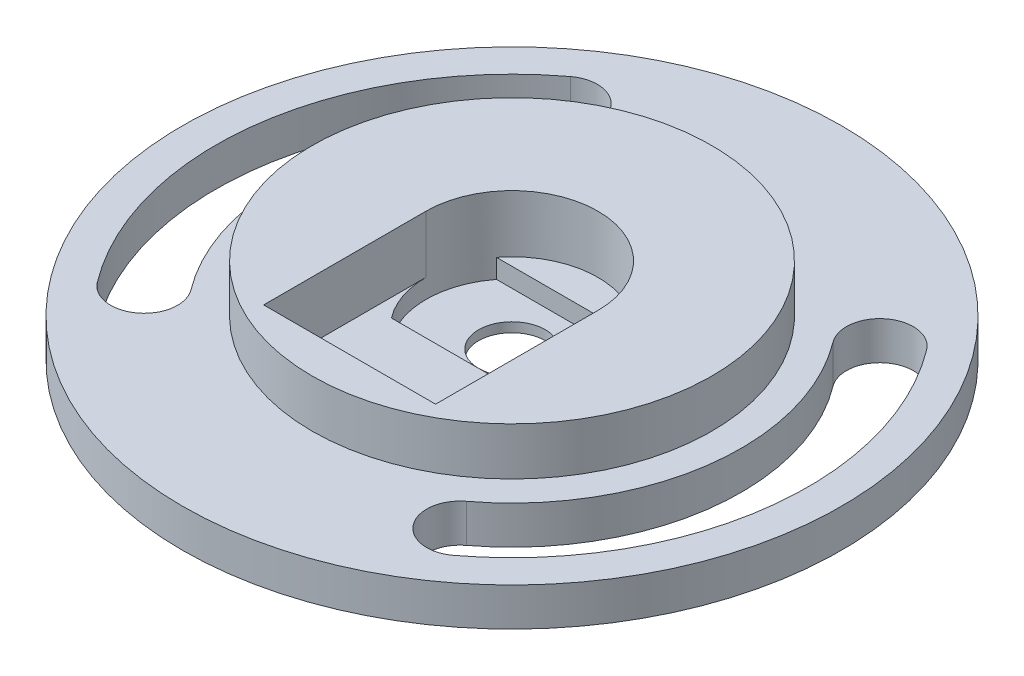
ISO-10303-21;
HEADER;
FILE_DESCRIPTION(('STEP AP214'),'2;1');
FILE_NAME('part.step','',(''),(''),'','','');
FILE_SCHEMA(('AUTOMOTIVE_DESIGN { 1 0 10303 214 1 1 1 1 }'));
ENDSEC;
DATA;
#1=APPLICATION_CONTEXT('core data for automotive mechanical design processes');
#2=APPLICATION_PROTOCOL_DEFINITION('international standard','automotive_design',2000,#1);
#3=PRODUCT_CONTEXT('',#1,'mechanical');
#4=PRODUCT('Part','Part','',(#3));
#5=PRODUCT_RELATED_PRODUCT_CATEGORY('part','',(#4));
#6=PRODUCT_DEFINITION_FORMATION('','',#4);
#7=PRODUCT_DEFINITION_CONTEXT('part definition',#1,'design');
#8=PRODUCT_DEFINITION('design','',#6,#7);
#9=PRODUCT_DEFINITION_SHAPE('','',#8);
#10=(LENGTH_UNIT() NAMED_UNIT(*) SI_UNIT(.MILLI.,.METRE.));
#11=(NAMED_UNIT(*) PLANE_ANGLE_UNIT() SI_UNIT($,.RADIAN.));
#12=(NAMED_UNIT(*) SI_UNIT($,.STERADIAN.) SOLID_ANGLE_UNIT());
#13=UNCERTAINTY_MEASURE_WITH_UNIT(LENGTH_MEASURE(1.E-05),#10,'distance_accuracy_value','');
#14=(GEOMETRIC_REPRESENTATION_CONTEXT(3) GLOBAL_UNCERTAINTY_ASSIGNED_CONTEXT((#13)) GLOBAL_UNIT_ASSIGNED_CONTEXT((#10,
#11,#12)) REPRESENTATION_CONTEXT('',''));
#15=CARTESIAN_POINT('',(0.,0.,0.));
#16=DIRECTION('',(0.,0.,1.));
#17=DIRECTION('',(1.,0.,0.));
#18=AXIS2_PLACEMENT_3D('',#15,#16,#17);
#19=CARTESIAN_POINT('',(0.,3.,0.));
#20=DIRECTION('',(0.,1.,0.));
#21=DIRECTION('',(0.,0.,1.));
#22=AXIS2_PLACEMENT_3D('',#19,#20,#21);
#23=PLANE('',#22);
#24=CARTESIAN_POINT('',(0.,3.,0.));
#25=DIRECTION('',(0.,1.,0.));
#26=DIRECTION('',(0.,0.,1.));
#27=AXIS2_PLACEMENT_3D('',#24,#25,#26);
#28=CIRCLE('',#27,9.);
#29=CARTESIAN_POINT('',(7.1239034243875,3.,5.5));
#30=VERTEX_POINT('',#29);
#31=CARTESIAN_POINT('',(9.,3.,0.));
#32=VERTEX_POINT('',#31);
#33=EDGE_CURVE('E193',#30,#32,#28,.T.);
#34=ORIENTED_EDGE('',*,*,#33,.F.);
#35=DIRECTION('',(1.,0.,0.));
#36=VECTOR('',#35,1.);
#37=CARTESIAN_POINT('',(7.1239034243875,3.,5.5));
#38=LINE('',#37,#36);
#39=CARTESIAN_POINT('',(-7.1239034243875,3.,5.5));
#40=VERTEX_POINT('',#39);
#41=EDGE_CURVE('E202',#40,#30,#38,.T.);
#42=ORIENTED_EDGE('',*,*,#41,.F.);
#43=CARTESIAN_POINT('',(0.,3.,0.));
#44=DIRECTION('',(0.,1.,0.));
#45=DIRECTION('',(0.,0.,1.));
#46=AXIS2_PLACEMENT_3D('',#43,#44,#45);
#47=CIRCLE('',#46,9.);
#48=CARTESIAN_POINT('',(-9.,3.,0.));
#49=VERTEX_POINT('',#48);
#50=EDGE_CURVE('E216',#49,#40,#47,.T.);
#51=ORIENTED_EDGE('',*,*,#50,.F.);
#52=DIRECTION('',(0.,0.,1.));
#53=VECTOR('',#52,1.);
#54=CARTESIAN_POINT('',(-9.,3.,0.));
#55=LINE('',#54,#53);
#56=CARTESIAN_POINT('',(-9.,3.,17.));
#57=VERTEX_POINT('',#56);
#58=EDGE_CURVE('E236',#49,#57,#55,.T.);
#59=ORIENTED_EDGE('',*,*,#58,.T.);
#60=DIRECTION('',(1.,0.,0.));
#61=VECTOR('',#60,1.);
#62=CARTESIAN_POINT('',(-9.,3.,17.));
#63=LINE('',#62,#61);
#64=CARTESIAN_POINT('',(9.,3.,17.));
#65=VERTEX_POINT('',#64);
#66=EDGE_CURVE('E240',#57,#65,#63,.T.);
#67=ORIENTED_EDGE('',*,*,#66,.T.);
#68=DIRECTION('',(0.,0.,-1.));
#69=VECTOR('',#68,1.);
#70=CARTESIAN_POINT('',(9.,3.,0.));
#71=LINE('',#70,#69);
#72=EDGE_CURVE('E243',#65,#32,#71,.T.);
#73=ORIENTED_EDGE('',*,*,#72,.T.);
#74=EDGE_LOOP('',(#34,#42,#51,#59,#67,#73));
#75=FACE_BOUND('',#74,.T.);
#76=ADVANCED_FACE('F33',(#75),#23,.T.);
#77=CARTESIAN_POINT('',(0.,0.,0.));
#78=DIRECTION('',(0.,1.,0.));
#79=DIRECTION('',(0.,0.,1.));
#80=AXIS2_PLACEMENT_3D('',#77,#78,#79);
#81=CYLINDRICAL_SURFACE('',#80,3.5);
#82=CARTESIAN_POINT('',(0.,0.,0.));
#83=DIRECTION('',(0.,1.,0.));
#84=DIRECTION('',(0.,0.,1.));
#85=AXIS2_PLACEMENT_3D('',#82,#83,#84);
#86=CIRCLE('',#85,3.5);
#87=CARTESIAN_POINT('',(0.,0.,3.5));
#88=VERTEX_POINT('',#87);
#89=EDGE_CURVE('E229',#88,#88,#86,.T.);
#90=ORIENTED_EDGE('',*,*,#89,.F.);
#91=EDGE_LOOP('',(#90));
#92=FACE_BOUND('',#91,.T.);
#93=CARTESIAN_POINT('',(0.,1.,0.));
#94=DIRECTION('',(0.,1.,0.));
#95=DIRECTION('',(0.,0.,1.));
#96=AXIS2_PLACEMENT_3D('',#93,#94,#95);
#97=CIRCLE('',#96,3.5);
#98=CARTESIAN_POINT('',(0.,1.,3.5));
#99=VERTEX_POINT('',#98);
#100=EDGE_CURVE('E222',#99,#99,#97,.F.);
#101=ORIENTED_EDGE('',*,*,#100,.F.);
#102=EDGE_LOOP('',(#101));
#103=FACE_BOUND('',#102,.T.);
#104=ADVANCED_FACE('F362',(#92,#103),#81,.F.);
#105=CARTESIAN_POINT('',(0.,4.,0.));
#106=DIRECTION('',(0.,-1.,0.));
#107=DIRECTION('',(0.,0.,-1.));
#108=AXIS2_PLACEMENT_3D('',#105,#106,#107);
#109=CYLINDRICAL_SURFACE('',#108,34.5);
#110=CARTESIAN_POINT('',(0.,4.,0.));
#111=DIRECTION('',(0.,1.,0.));
#112=DIRECTION('',(0.,0.,1.));
#113=AXIS2_PLACEMENT_3D('',#110,#111,#112);
#114=CIRCLE('',#113,34.5);
#115=CARTESIAN_POINT('',(0.,4.,34.5));
#116=VERTEX_POINT('',#115);
#117=EDGE_CURVE('E335',#116,#116,#114,.T.);
#118=ORIENTED_EDGE('',*,*,#117,.F.);
#119=EDGE_LOOP('',(#118));
#120=FACE_BOUND('',#119,.T.);
#121=CARTESIAN_POINT('',(0.,0.,0.));
#122=DIRECTION('',(0.,1.,0.));
#123=DIRECTION('',(0.,0.,1.));
#124=AXIS2_PLACEMENT_3D('',#121,#122,#123);
#125=CIRCLE('',#124,34.5);
#126=CARTESIAN_POINT('',(0.,0.,34.5));
#127=VERTEX_POINT('',#126);
#128=EDGE_CURVE('E334',#127,#127,#125,.T.);
#129=ORIENTED_EDGE('',*,*,#128,.T.);
#130=EDGE_LOOP('',(#129));
#131=FACE_BOUND('',#130,.T.);
#132=ADVANCED_FACE('F35',(#120,#131),#109,.T.);
#133=CARTESIAN_POINT('',(0.,4.,0.));
#134=DIRECTION('',(0.,1.,0.));
#135=DIRECTION('',(0.,0.,1.));
#136=AXIS2_PLACEMENT_3D('',#133,#134,#135);
#137=PLANE('',#136);
#138=CARTESIAN_POINT('',(0.,4.,0.));
#139=DIRECTION('',(0.,1.,0.));
#140=DIRECTION('',(0.,0.,1.));
#141=AXIS2_PLACEMENT_3D('',#138,#139,#140);
#142=CIRCLE('',#141,20.9120133638863);
#143=CARTESIAN_POINT('',(0.,4.,20.9120133638863));
#144=VERTEX_POINT('',#143);
#145=EDGE_CURVE('E258',#144,#144,#142,.T.);
#146=ORIENTED_EDGE('',*,*,#145,.F.);
#147=EDGE_LOOP('',(#146));
#148=FACE_BOUND('',#147,.T.);
#149=CARTESIAN_POINT('',(16.540332472647,4.,21.9696927992701));
#150=DIRECTION('',(0.,1.,0.));
#151=DIRECTION('',(0.,0.,1.));
#152=AXIS2_PLACEMENT_3D('',#149,#150,#151);
#153=CIRCLE('',#152,3.5);
#154=CARTESIAN_POINT('',(14.4351992488556,4.,19.173550079363));
#155=VERTEX_POINT('',#154);
#156=CARTESIAN_POINT('',(18.6454656964384,4.,24.7658355191772));
#157=VERTEX_POINT('',#156);
#158=EDGE_CURVE('E299',#155,#157,#153,.T.);
#159=ORIENTED_EDGE('',*,*,#158,.F.);
#160=CARTESIAN_POINT('',(0.,4.,0.));
#161=DIRECTION('',(0.,1.,0.));
#162=DIRECTION('',(0.,0.,1.));
#163=AXIS2_PLACEMENT_3D('',#160,#161,#162);
#164=CIRCLE('',#163,24.);
#165=CARTESIAN_POINT('',(19.173550079363,4.,-14.4351992488555));
#166=VERTEX_POINT('',#165);
#167=EDGE_CURVE('E297',#166,#155,#164,.F.);
#168=ORIENTED_EDGE('',*,*,#167,.F.);
#169=CARTESIAN_POINT('',(21.9696927992701,4.,-16.5403324726469));
#170=DIRECTION('',(0.,1.,0.));
#171=DIRECTION('',(0.,0.,1.));
#172=AXIS2_PLACEMENT_3D('',#169,#170,#171);
#173=CIRCLE('',#172,3.5);
#174=CARTESIAN_POINT('',(24.7658355191772,4.,-18.6454656964383));
#175=VERTEX_POINT('',#174);
#176=EDGE_CURVE('E295',#175,#166,#173,.T.);
#177=ORIENTED_EDGE('',*,*,#176,.F.);
#178=CARTESIAN_POINT('',(0.,4.,0.));
#179=DIRECTION('',(0.,1.,0.));
#180=DIRECTION('',(0.,0.,1.));
#181=AXIS2_PLACEMENT_3D('',#178,#179,#180);
#182=CIRCLE('',#181,31.);
#183=EDGE_CURVE('E286',#157,#175,#182,.T.);
#184=ORIENTED_EDGE('',*,*,#183,.F.);
#185=EDGE_LOOP('',(#159,#168,#177,#184));
#186=FACE_BOUND('',#185,.T.);
#187=CARTESIAN_POINT('',(-16.540332472647,4.,-21.9696927992701));
#188=DIRECTION('',(0.,1.,0.));
#189=DIRECTION('',(0.,0.,1.));
#190=AXIS2_PLACEMENT_3D('',#187,#188,#189);
#191=CIRCLE('',#190,3.5);
#192=CARTESIAN_POINT('',(-14.4351992488556,4.,-19.173550079363));
#193=VERTEX_POINT('',#192);
#194=CARTESIAN_POINT('',(-18.6454656964384,4.,-24.7658355191772));
#195=VERTEX_POINT('',#194);
#196=EDGE_CURVE('E331',#193,#195,#191,.T.);
#197=ORIENTED_EDGE('',*,*,#196,.F.);
#198=CARTESIAN_POINT('',(0.,4.,0.));
#199=DIRECTION('',(0.,1.,0.));
#200=DIRECTION('',(0.,0.,1.));
#201=AXIS2_PLACEMENT_3D('',#198,#199,#200);
#202=CIRCLE('',#201,24.);
#203=CARTESIAN_POINT('',(-19.173550079363,4.,14.4351992488555));
#204=VERTEX_POINT('',#203);
#205=EDGE_CURVE('E329',#204,#193,#202,.F.);
#206=ORIENTED_EDGE('',*,*,#205,.F.);
#207=CARTESIAN_POINT('',(-21.9696927992701,4.,16.5403324726469));
#208=DIRECTION('',(0.,1.,0.));
#209=DIRECTION('',(0.,0.,1.));
#210=AXIS2_PLACEMENT_3D('',#207,#208,#209);
#211=CIRCLE('',#210,3.5);
#212=CARTESIAN_POINT('',(-24.7658355191772,4.,18.6454656964383));
#213=VERTEX_POINT('',#212);
#214=EDGE_CURVE('E327',#213,#204,#211,.T.);
#215=ORIENTED_EDGE('',*,*,#214,.F.);
#216=CARTESIAN_POINT('',(0.,4.,0.));
#217=DIRECTION('',(0.,1.,0.));
#218=DIRECTION('',(0.,0.,1.));
#219=AXIS2_PLACEMENT_3D('',#216,#217,#218);
#220=CIRCLE('',#219,31.);
#221=EDGE_CURVE('E318',#195,#213,#220,.T.);
#222=ORIENTED_EDGE('',*,*,#221,.F.);
#223=EDGE_LOOP('',(#197,#206,#215,#222));
#224=FACE_BOUND('',#223,.T.);
#225=ORIENTED_EDGE('',*,*,#117,.T.);
#226=EDGE_LOOP('',(#225));
#227=FACE_BOUND('',#226,.T.);
#228=ADVANCED_FACE('F459',(#148,#186,#224,#227),#137,.T.);
#229=CARTESIAN_POINT('',(0.,0.,0.));
#230=DIRECTION('',(0.,1.,0.));
#231=DIRECTION('',(0.,0.,1.));
#232=AXIS2_PLACEMENT_3D('',#229,#230,#231);
#233=PLANE('',#232);
#234=DIRECTION('',(-1.,0.,0.));
#235=VECTOR('',#234,1.);
#236=CARTESIAN_POINT('',(6.76314887116603,0.,-1.63806730248339));
#237=LINE('',#236,#235);
#238=CARTESIAN_POINT('',(8.76314887116603,0.,-1.63806730248339));
#239=VERTEX_POINT('',#238);
#240=CARTESIAN_POINT('',(6.76314887116603,0.,-1.63806730248339));
#241=VERTEX_POINT('',#240);
#242=EDGE_CURVE('E177',#239,#241,#237,.T.);
#243=ORIENTED_EDGE('',*,*,#242,.T.);
#244=DIRECTION('',(0.,0.,1.));
#245=VECTOR('',#244,1.);
#246=CARTESIAN_POINT('',(6.76314887116603,0.,-1.63806730248339));
#247=LINE('',#246,#245);
#248=CARTESIAN_POINT('',(6.76314887116603,0.,1.36193269751661));
#249=VERTEX_POINT('',#248);
#250=EDGE_CURVE('E172',#241,#249,#247,.T.);
#251=ORIENTED_EDGE('',*,*,#250,.T.);
#252=DIRECTION('',(1.,0.,0.));
#253=VECTOR('',#252,1.);
#254=CARTESIAN_POINT('',(6.76314887116603,0.,1.36193269751661));
#255=LINE('',#254,#253);
#256=CARTESIAN_POINT('',(8.76314887116603,0.,1.36193269751661));
#257=VERTEX_POINT('',#256);
#258=EDGE_CURVE('E180',#249,#257,#255,.T.);
#259=ORIENTED_EDGE('',*,*,#258,.T.);
#260=DIRECTION('',(0.,0.,-1.));
#261=VECTOR('',#260,1.);
#262=CARTESIAN_POINT('',(8.76314887116603,0.,-1.63806730248339));
#263=LINE('',#262,#261);
#264=EDGE_CURVE('E48',#257,#239,#263,.T.);
#265=ORIENTED_EDGE('',*,*,#264,.T.);
#266=EDGE_LOOP('',(#243,#251,#259,#265));
#267=FACE_BOUND('',#266,.T.);
#268=ORIENTED_EDGE('',*,*,#89,.T.);
#269=EDGE_LOOP('',(#268));
#270=FACE_BOUND('',#269,.T.);
#271=CARTESIAN_POINT('',(0.,0.,0.));
#272=DIRECTION('',(0.,-1.,0.));
#273=DIRECTION('',(0.,0.,1.));
#274=AXIS2_PLACEMENT_3D('',#271,#272,#273);
#275=CIRCLE('',#274,24.);
#276=CARTESIAN_POINT('',(19.173550079363,0.,-14.4351992488555));
#277=VERTEX_POINT('',#276);
#278=CARTESIAN_POINT('',(14.4351992488556,0.,19.173550079363));
#279=VERTEX_POINT('',#278);
#280=EDGE_CURVE('E279',#277,#279,#275,.T.);
#281=ORIENTED_EDGE('',*,*,#280,.T.);
#282=CARTESIAN_POINT('',(16.540332472647,0.,21.9696927992701));
#283=DIRECTION('',(0.,1.,0.));
#284=DIRECTION('',(0.,0.,-1.));
#285=AXIS2_PLACEMENT_3D('',#282,#283,#284);
#286=CIRCLE('',#285,3.5);
#287=CARTESIAN_POINT('',(18.6454656964384,0.,24.7658355191772));
#288=VERTEX_POINT('',#287);
#289=EDGE_CURVE('E268',#279,#288,#286,.T.);
#290=ORIENTED_EDGE('',*,*,#289,.T.);
#291=CARTESIAN_POINT('',(0.,0.,0.));
#292=DIRECTION('',(0.,1.,0.));
#293=DIRECTION('',(0.,0.,1.));
#294=AXIS2_PLACEMENT_3D('',#291,#292,#293);
#295=CIRCLE('',#294,31.);
#296=CARTESIAN_POINT('',(24.7658355191772,0.,-18.6454656964383));
#297=VERTEX_POINT('',#296);
#298=EDGE_CURVE('E273',#288,#297,#295,.T.);
#299=ORIENTED_EDGE('',*,*,#298,.T.);
#300=CARTESIAN_POINT('',(21.9696927992701,0.,-16.5403324726469));
#301=DIRECTION('',(0.,1.,0.));
#302=DIRECTION('',(0.,0.,1.));
#303=AXIS2_PLACEMENT_3D('',#300,#301,#302);
#304=CIRCLE('',#303,3.5);
#305=EDGE_CURVE('E276',#297,#277,#304,.T.);
#306=ORIENTED_EDGE('',*,*,#305,.T.);
#307=EDGE_LOOP('',(#281,#290,#299,#306));
#308=FACE_BOUND('',#307,.T.);
#309=CARTESIAN_POINT('',(0.,0.,0.));
#310=DIRECTION('',(0.,-1.,0.));
#311=DIRECTION('',(0.,0.,1.));
#312=AXIS2_PLACEMENT_3D('',#309,#310,#311);
#313=CIRCLE('',#312,24.);
#314=CARTESIAN_POINT('',(-19.173550079363,0.,14.4351992488555));
#315=VERTEX_POINT('',#314);
#316=CARTESIAN_POINT('',(-14.4351992488556,0.,-19.173550079363));
#317=VERTEX_POINT('',#316);
#318=EDGE_CURVE('E311',#315,#317,#313,.T.);
#319=ORIENTED_EDGE('',*,*,#318,.T.);
#320=CARTESIAN_POINT('',(-16.540332472647,0.,-21.9696927992701));
#321=DIRECTION('',(0.,1.,0.));
#322=DIRECTION('',(0.,0.,-1.));
#323=AXIS2_PLACEMENT_3D('',#320,#321,#322);
#324=CIRCLE('',#323,3.5);
#325=CARTESIAN_POINT('',(-18.6454656964384,0.,-24.7658355191772));
#326=VERTEX_POINT('',#325);
#327=EDGE_CURVE('E302',#317,#326,#324,.T.);
#328=ORIENTED_EDGE('',*,*,#327,.T.);
#329=CARTESIAN_POINT('',(0.,0.,0.));
#330=DIRECTION('',(0.,1.,0.));
#331=DIRECTION('',(0.,0.,1.));
#332=AXIS2_PLACEMENT_3D('',#329,#330,#331);
#333=CIRCLE('',#332,31.);
#334=CARTESIAN_POINT('',(-24.7658355191772,0.,18.6454656964383));
#335=VERTEX_POINT('',#334);
#336=EDGE_CURVE('E305',#326,#335,#333,.T.);
#337=ORIENTED_EDGE('',*,*,#336,.T.);
#338=CARTESIAN_POINT('',(-21.9696927992701,0.,16.5403324726469));
#339=DIRECTION('',(0.,1.,0.));
#340=DIRECTION('',(0.,0.,1.));
#341=AXIS2_PLACEMENT_3D('',#338,#339,#340);
#342=CIRCLE('',#341,3.5);
#343=EDGE_CURVE('E308',#335,#315,#342,.T.);
#344=ORIENTED_EDGE('',*,*,#343,.T.);
#345=EDGE_LOOP('',(#319,#328,#337,#344));
#346=FACE_BOUND('',#345,.T.);
#347=ORIENTED_EDGE('',*,*,#128,.F.);
#348=EDGE_LOOP('',(#347));
#349=FACE_BOUND('',#348,.T.);
#350=ADVANCED_FACE('F184',(#267,#270,#308,#346,#349),#233,.F.);
#351=CARTESIAN_POINT('',(-16.540332472647,0.,-21.9696927992701));
#352=DIRECTION('',(0.,1.,0.));
#353=DIRECTION('',(0.,0.,1.));
#354=AXIS2_PLACEMENT_3D('',#351,#352,#353);
#355=CYLINDRICAL_SURFACE('',#354,3.5);
#356=ORIENTED_EDGE('',*,*,#196,.T.);
#357=DIRECTION('',(0.,1.,0.));
#358=VECTOR('',#357,1.);
#359=CARTESIAN_POINT('',(-18.6454656964384,0.,-24.7658355191772));
#360=LINE('',#359,#358);
#361=EDGE_CURVE('E314',#326,#195,#360,.T.);
#362=ORIENTED_EDGE('',*,*,#361,.F.);
#363=ORIENTED_EDGE('',*,*,#327,.F.);
#364=DIRECTION('',(0.,1.,0.));
#365=VECTOR('',#364,1.);
#366=CARTESIAN_POINT('',(-14.4351992488556,0.,-19.173550079363));
#367=LINE('',#366,#365);
#368=EDGE_CURVE('E315',#317,#193,#367,.T.);
#369=ORIENTED_EDGE('',*,*,#368,.T.);
#370=EDGE_LOOP('',(#356,#362,#363,#369));
#371=FACE_BOUND('',#370,.T.);
#372=ADVANCED_FACE('F448',(#371),#355,.F.);
#373=CARTESIAN_POINT('',(0.,0.,0.));
#374=DIRECTION('',(0.,1.,0.));
#375=DIRECTION('',(0.,0.,1.));
#376=AXIS2_PLACEMENT_3D('',#373,#374,#375);
#377=CYLINDRICAL_SURFACE('',#376,24.);
#378=ORIENTED_EDGE('',*,*,#205,.T.);
#379=ORIENTED_EDGE('',*,*,#368,.F.);
#380=ORIENTED_EDGE('',*,*,#318,.F.);
#381=DIRECTION('',(0.,1.,0.));
#382=VECTOR('',#381,1.);
#383=CARTESIAN_POINT('',(-19.173550079363,0.,14.4351992488555));
#384=LINE('',#383,#382);
#385=EDGE_CURVE('E319',#315,#204,#384,.T.);
#386=ORIENTED_EDGE('',*,*,#385,.T.);
#387=EDGE_LOOP('',(#378,#379,#380,#386));
#388=FACE_BOUND('',#387,.T.);
#389=ADVANCED_FACE('F444',(#388),#377,.T.);
#390=CARTESIAN_POINT('',(-21.9696927992701,0.,16.5403324726469));
#391=DIRECTION('',(0.,1.,0.));
#392=DIRECTION('',(0.,0.,1.));
#393=AXIS2_PLACEMENT_3D('',#390,#391,#392);
#394=CYLINDRICAL_SURFACE('',#393,3.5);
#395=ORIENTED_EDGE('',*,*,#214,.T.);
#396=ORIENTED_EDGE('',*,*,#385,.F.);
#397=ORIENTED_EDGE('',*,*,#343,.F.);
#398=DIRECTION('',(0.,1.,0.));
#399=VECTOR('',#398,1.);
#400=CARTESIAN_POINT('',(-24.7658355191772,0.,18.6454656964383));
#401=LINE('',#400,#399);
#402=EDGE_CURVE('E322',#335,#213,#401,.T.);
#403=ORIENTED_EDGE('',*,*,#402,.T.);
#404=EDGE_LOOP('',(#395,#396,#397,#403));
#405=FACE_BOUND('',#404,.T.);
#406=ADVANCED_FACE('F447',(#405),#394,.F.);
#407=CARTESIAN_POINT('',(0.,0.,0.));
#408=DIRECTION('',(0.,1.,0.));
#409=DIRECTION('',(0.,0.,1.));
#410=AXIS2_PLACEMENT_3D('',#407,#408,#409);
#411=CYLINDRICAL_SURFACE('',#410,31.);
#412=ORIENTED_EDGE('',*,*,#221,.T.);
#413=ORIENTED_EDGE('',*,*,#402,.F.);
#414=ORIENTED_EDGE('',*,*,#336,.F.);
#415=ORIENTED_EDGE('',*,*,#361,.T.);
#416=EDGE_LOOP('',(#412,#413,#414,#415));
#417=FACE_BOUND('',#416,.T.);
#418=ADVANCED_FACE('F442',(#417),#411,.F.);
#419=CARTESIAN_POINT('',(16.540332472647,0.,21.9696927992701));
#420=DIRECTION('',(0.,1.,0.));
#421=DIRECTION('',(0.,0.,1.));
#422=AXIS2_PLACEMENT_3D('',#419,#420,#421);
#423=CYLINDRICAL_SURFACE('',#422,3.5);
#424=ORIENTED_EDGE('',*,*,#158,.T.);
#425=DIRECTION('',(0.,1.,0.));
#426=VECTOR('',#425,1.);
#427=CARTESIAN_POINT('',(18.6454656964384,0.,24.7658355191772));
#428=LINE('',#427,#426);
#429=EDGE_CURVE('E282',#288,#157,#428,.T.);
#430=ORIENTED_EDGE('',*,*,#429,.F.);
#431=ORIENTED_EDGE('',*,*,#289,.F.);
#432=DIRECTION('',(0.,1.,0.));
#433=VECTOR('',#432,1.);
#434=CARTESIAN_POINT('',(14.4351992488556,0.,19.173550079363));
#435=LINE('',#434,#433);
#436=EDGE_CURVE('E283',#279,#155,#435,.T.);
#437=ORIENTED_EDGE('',*,*,#436,.T.);
#438=EDGE_LOOP('',(#424,#430,#431,#437));
#439=FACE_BOUND('',#438,.T.);
#440=ADVANCED_FACE('F432',(#439),#423,.F.);
#441=CARTESIAN_POINT('',(0.,0.,0.));
#442=DIRECTION('',(0.,1.,0.));
#443=DIRECTION('',(0.,0.,1.));
#444=AXIS2_PLACEMENT_3D('',#441,#442,#443);
#445=CYLINDRICAL_SURFACE('',#444,24.);
#446=ORIENTED_EDGE('',*,*,#167,.T.);
#447=ORIENTED_EDGE('',*,*,#436,.F.);
#448=ORIENTED_EDGE('',*,*,#280,.F.);
#449=DIRECTION('',(0.,1.,0.));
#450=VECTOR('',#449,1.);
#451=CARTESIAN_POINT('',(19.173550079363,0.,-14.4351992488555));
#452=LINE('',#451,#450);
#453=EDGE_CURVE('E287',#277,#166,#452,.T.);
#454=ORIENTED_EDGE('',*,*,#453,.T.);
#455=EDGE_LOOP('',(#446,#447,#448,#454));
#456=FACE_BOUND('',#455,.T.);
#457=ADVANCED_FACE('F428',(#456),#445,.T.);
#458=CARTESIAN_POINT('',(21.9696927992701,0.,-16.5403324726469));
#459=DIRECTION('',(0.,1.,0.));
#460=DIRECTION('',(0.,0.,1.));
#461=AXIS2_PLACEMENT_3D('',#458,#459,#460);
#462=CYLINDRICAL_SURFACE('',#461,3.5);
#463=ORIENTED_EDGE('',*,*,#176,.T.);
#464=ORIENTED_EDGE('',*,*,#453,.F.);
#465=ORIENTED_EDGE('',*,*,#305,.F.);
#466=DIRECTION('',(0.,1.,0.));
#467=VECTOR('',#466,1.);
#468=CARTESIAN_POINT('',(24.7658355191772,0.,-18.6454656964383));
#469=LINE('',#468,#467);
#470=EDGE_CURVE('E290',#297,#175,#469,.T.);
#471=ORIENTED_EDGE('',*,*,#470,.T.);
#472=EDGE_LOOP('',(#463,#464,#465,#471));
#473=FACE_BOUND('',#472,.T.);
#474=ADVANCED_FACE('F431',(#473),#462,.F.);
#475=CARTESIAN_POINT('',(0.,0.,0.));
#476=DIRECTION('',(0.,1.,0.));
#477=DIRECTION('',(0.,0.,1.));
#478=AXIS2_PLACEMENT_3D('',#475,#476,#477);
#479=CYLINDRICAL_SURFACE('',#478,31.);
#480=ORIENTED_EDGE('',*,*,#183,.T.);
#481=ORIENTED_EDGE('',*,*,#470,.F.);
#482=ORIENTED_EDGE('',*,*,#298,.F.);
#483=ORIENTED_EDGE('',*,*,#429,.T.);
#484=EDGE_LOOP('',(#480,#481,#482,#483));
#485=FACE_BOUND('',#484,.T.);
#486=ADVANCED_FACE('F426',(#485),#479,.F.);
#487=CARTESIAN_POINT('',(0.,9.,0.));
#488=DIRECTION('',(0.,-1.,0.));
#489=DIRECTION('',(0.,0.,-1.));
#490=AXIS2_PLACEMENT_3D('',#487,#488,#489);
#491=CYLINDRICAL_SURFACE('',#490,20.9120133638863);
#492=CARTESIAN_POINT('',(0.,9.,0.));
#493=DIRECTION('',(0.,1.,0.));
#494=DIRECTION('',(0.,0.,1.));
#495=AXIS2_PLACEMENT_3D('',#492,#493,#494);
#496=CIRCLE('',#495,20.9120133638863);
#497=CARTESIAN_POINT('',(0.,9.,20.9120133638863));
#498=VERTEX_POINT('',#497);
#499=EDGE_CURVE('E265',#498,#498,#496,.T.);
#500=ORIENTED_EDGE('',*,*,#499,.F.);
#501=EDGE_LOOP('',(#500));
#502=FACE_BOUND('',#501,.T.);
#503=ORIENTED_EDGE('',*,*,#145,.T.);
#504=EDGE_LOOP('',(#503));
#505=FACE_BOUND('',#504,.T.);
#506=ADVANCED_FACE('F423',(#502,#505),#491,.T.);
#507=CARTESIAN_POINT('',(0.,9.,0.));
#508=DIRECTION('',(0.,1.,0.));
#509=DIRECTION('',(0.,0.,1.));
#510=AXIS2_PLACEMENT_3D('',#507,#508,#509);
#511=PLANE('',#510);
#512=CARTESIAN_POINT('',(0.,9.,0.));
#513=DIRECTION('',(0.,1.,0.));
#514=DIRECTION('',(0.,0.,1.));
#515=AXIS2_PLACEMENT_3D('',#512,#513,#514);
#516=CIRCLE('',#515,9.);
#517=CARTESIAN_POINT('',(9.,9.,0.));
#518=VERTEX_POINT('',#517);
#519=CARTESIAN_POINT('',(-9.,9.,0.));
#520=VERTEX_POINT('',#519);
#521=EDGE_CURVE('E232',#518,#520,#516,.T.);
#522=ORIENTED_EDGE('',*,*,#521,.F.);
#523=DIRECTION('',(0.,0.,-1.));
#524=VECTOR('',#523,1.);
#525=CARTESIAN_POINT('',(9.,9.,0.));
#526=LINE('',#525,#524);
#527=CARTESIAN_POINT('',(9.,9.,17.));
#528=VERTEX_POINT('',#527);
#529=EDGE_CURVE('E237',#528,#518,#526,.T.);
#530=ORIENTED_EDGE('',*,*,#529,.F.);
#531=DIRECTION('',(1.,0.,0.));
#532=VECTOR('',#531,1.);
#533=CARTESIAN_POINT('',(-9.,9.,17.));
#534=LINE('',#533,#532);
#535=CARTESIAN_POINT('',(-9.,9.,17.));
#536=VERTEX_POINT('',#535);
#537=EDGE_CURVE('E251',#536,#528,#534,.T.);
#538=ORIENTED_EDGE('',*,*,#537,.F.);
#539=DIRECTION('',(0.,0.,1.));
#540=VECTOR('',#539,1.);
#541=CARTESIAN_POINT('',(-9.,9.,0.));
#542=LINE('',#541,#540);
#543=EDGE_CURVE('E248',#520,#536,#542,.T.);
#544=ORIENTED_EDGE('',*,*,#543,.F.);
#545=EDGE_LOOP('',(#522,#530,#538,#544));
#546=FACE_BOUND('',#545,.T.);
#547=ORIENTED_EDGE('',*,*,#499,.T.);
#548=EDGE_LOOP('',(#547));
#549=FACE_BOUND('',#548,.T.);
#550=ADVANCED_FACE('F410',(#546,#549),#511,.T.);
#551=CARTESIAN_POINT('',(0.,3.,0.));
#552=DIRECTION('',(0.,1.,0.));
#553=DIRECTION('',(0.,0.,1.));
#554=AXIS2_PLACEMENT_3D('',#551,#552,#553);
#555=CYLINDRICAL_SURFACE('',#554,9.);
#556=ORIENTED_EDGE('',*,*,#521,.T.);
#557=DIRECTION('',(0.,1.,0.));
#558=VECTOR('',#557,1.);
#559=CARTESIAN_POINT('',(-9.,3.,0.));
#560=LINE('',#559,#558);
#561=EDGE_CURVE('E246',#49,#520,#560,.T.);
#562=ORIENTED_EDGE('',*,*,#561,.F.);
#563=ORIENTED_EDGE('',*,*,#50,.T.);
#564=DIRECTION('',(0.,1.,0.));
#565=VECTOR('',#564,1.);
#566=CARTESIAN_POINT('',(-7.1239034243875,1.,5.5));
#567=LINE('',#566,#565);
#568=CARTESIAN_POINT('',(-7.1239034243875,1.,5.5));
#569=VERTEX_POINT('',#568);
#570=EDGE_CURVE('E223',#569,#40,#567,.T.);
#571=ORIENTED_EDGE('',*,*,#570,.F.);
#572=CARTESIAN_POINT('',(0.,1.,0.));
#573=DIRECTION('',(0.,1.,0.));
#574=DIRECTION('',(0.,0.,1.));
#575=AXIS2_PLACEMENT_3D('',#572,#573,#574);
#576=CIRCLE('',#575,9.);
#577=CARTESIAN_POINT('',(-7.1239034243875,1.,-5.5));
#578=VERTEX_POINT('',#577);
#579=EDGE_CURVE('E205',#578,#569,#576,.T.);
#580=ORIENTED_EDGE('',*,*,#579,.F.);
#581=DIRECTION('',(0.,1.,0.));
#582=VECTOR('',#581,1.);
#583=CARTESIAN_POINT('',(-7.1239034243875,1.,-5.5));
#584=LINE('',#583,#582);
#585=CARTESIAN_POINT('',(-7.1239034243875,3.,-5.5));
#586=VERTEX_POINT('',#585);
#587=EDGE_CURVE('E226',#578,#586,#584,.T.);
#588=ORIENTED_EDGE('',*,*,#587,.T.);
#589=CARTESIAN_POINT('',(0.,3.,0.));
#590=DIRECTION('',(0.,1.,0.));
#591=DIRECTION('',(0.,0.,1.));
#592=AXIS2_PLACEMENT_3D('',#589,#590,#591);
#593=CIRCLE('',#592,9.);
#594=CARTESIAN_POINT('',(7.1239034243875,3.,-5.5));
#595=VERTEX_POINT('',#594);
#596=EDGE_CURVE('E233',#595,#586,#593,.T.);
#597=ORIENTED_EDGE('',*,*,#596,.F.);
#598=DIRECTION('',(0.,1.,0.));
#599=VECTOR('',#598,1.);
#600=CARTESIAN_POINT('',(7.1239034243875,1.,-5.5));
#601=LINE('',#600,#599);
#602=CARTESIAN_POINT('',(7.1239034243875,1.,-5.5));
#603=VERTEX_POINT('',#602);
#604=EDGE_CURVE('E211',#603,#595,#601,.T.);
#605=ORIENTED_EDGE('',*,*,#604,.F.);
#606=CARTESIAN_POINT('',(0.,1.,0.));
#607=DIRECTION('',(0.,1.,0.));
#608=DIRECTION('',(0.,0.,1.));
#609=AXIS2_PLACEMENT_3D('',#606,#607,#608);
#610=CIRCLE('',#609,9.);
#611=CARTESIAN_POINT('',(7.1239034243875,1.,5.5));
#612=VERTEX_POINT('',#611);
#613=EDGE_CURVE('E198',#612,#603,#610,.T.);
#614=ORIENTED_EDGE('',*,*,#613,.F.);
#615=DIRECTION('',(0.,1.,0.));
#616=VECTOR('',#615,1.);
#617=CARTESIAN_POINT('',(7.1239034243875,1.,5.5));
#618=LINE('',#617,#616);
#619=EDGE_CURVE('E220',#612,#30,#618,.T.);
#620=ORIENTED_EDGE('',*,*,#619,.T.);
#621=ORIENTED_EDGE('',*,*,#33,.T.);
#622=DIRECTION('',(0.,1.,0.));
#623=VECTOR('',#622,1.);
#624=CARTESIAN_POINT('',(9.,3.,0.));
#625=LINE('',#624,#623);
#626=EDGE_CURVE('E256',#32,#518,#625,.T.);
#627=ORIENTED_EDGE('',*,*,#626,.T.);
#628=EDGE_LOOP('',(#556,#562,#563,#571,#580,#588,#597,#605,#614,#620,#621,#627));
#629=FACE_BOUND('',#628,.T.);
#630=ADVANCED_FACE('F389',(#629),#555,.F.);
#631=CARTESIAN_POINT('',(9.,3.,0.));
#632=DIRECTION('',(1.,0.,0.));
#633=DIRECTION('',(0.,0.,-1.));
#634=AXIS2_PLACEMENT_3D('',#631,#632,#633);
#635=PLANE('',#634);
#636=ORIENTED_EDGE('',*,*,#529,.T.);
#637=ORIENTED_EDGE('',*,*,#626,.F.);
#638=ORIENTED_EDGE('',*,*,#72,.F.);
#639=DIRECTION('',(0.,1.,0.));
#640=VECTOR('',#639,1.);
#641=CARTESIAN_POINT('',(9.,3.,17.));
#642=LINE('',#641,#640);
#643=EDGE_CURVE('E259',#65,#528,#642,.T.);
#644=ORIENTED_EDGE('',*,*,#643,.T.);
#645=EDGE_LOOP('',(#636,#637,#638,#644));
#646=FACE_BOUND('',#645,.T.);
#647=ADVANCED_FACE('F402',(#646),#635,.F.);
#648=CARTESIAN_POINT('',(-9.,3.,17.));
#649=DIRECTION('',(0.,0.,1.));
#650=DIRECTION('',(1.,0.,0.));
#651=AXIS2_PLACEMENT_3D('',#648,#649,#650);
#652=PLANE('',#651);
#653=ORIENTED_EDGE('',*,*,#537,.T.);
#654=ORIENTED_EDGE('',*,*,#643,.F.);
#655=ORIENTED_EDGE('',*,*,#66,.F.);
#656=DIRECTION('',(0.,1.,0.));
#657=VECTOR('',#656,1.);
#658=CARTESIAN_POINT('',(-9.,3.,17.));
#659=LINE('',#658,#657);
#660=EDGE_CURVE('E261',#57,#536,#659,.T.);
#661=ORIENTED_EDGE('',*,*,#660,.T.);
#662=EDGE_LOOP('',(#653,#654,#655,#661));
#663=FACE_BOUND('',#662,.T.);
#664=ADVANCED_FACE('F382',(#663),#652,.F.);
#665=CARTESIAN_POINT('',(-9.,3.,0.));
#666=DIRECTION('',(-1.,0.,0.));
#667=DIRECTION('',(0.,0.,1.));
#668=AXIS2_PLACEMENT_3D('',#665,#666,#667);
#669=PLANE('',#668);
#670=ORIENTED_EDGE('',*,*,#543,.T.);
#671=ORIENTED_EDGE('',*,*,#660,.F.);
#672=ORIENTED_EDGE('',*,*,#58,.F.);
#673=ORIENTED_EDGE('',*,*,#561,.T.);
#674=EDGE_LOOP('',(#670,#671,#672,#673));
#675=FACE_BOUND('',#674,.T.);
#676=ADVANCED_FACE('F374',(#675),#669,.F.);
#677=DIRECTION('',(-1.,0.,0.));
#678=VECTOR('',#677,1.);
#679=CARTESIAN_POINT('',(7.1239034243875,3.,-5.5));
#680=LINE('',#679,#678);
#681=EDGE_CURVE('E213',#595,#586,#680,.T.);
#682=ORIENTED_EDGE('',*,*,#681,.F.);
#683=ORIENTED_EDGE('',*,*,#596,.T.);
#684=EDGE_LOOP('',(#682,#683));
#685=FACE_BOUND('',#684,.T.);
#686=ADVANCED_FACE('F365',(#685),#23,.T.);
#687=CARTESIAN_POINT('',(0.,1.,0.));
#688=DIRECTION('',(0.,1.,0.));
#689=DIRECTION('',(0.,0.,1.));
#690=AXIS2_PLACEMENT_3D('',#687,#688,#689);
#691=PLANE('',#690);
#692=DIRECTION('',(0.,0.,1.));
#693=VECTOR('',#692,1.);
#694=CARTESIAN_POINT('',(6.76314887116603,1.,0.));
#695=LINE('',#694,#693);
#696=CARTESIAN_POINT('',(6.76314887116603,1.,-1.63806730248339));
#697=VERTEX_POINT('',#696);
#698=CARTESIAN_POINT('',(6.76314887116603,1.,1.36193269751661));
#699=VERTEX_POINT('',#698);
#700=EDGE_CURVE('E11',#697,#699,#695,.T.);
#701=ORIENTED_EDGE('',*,*,#700,.F.);
#702=DIRECTION('',(-1.,0.,0.));
#703=VECTOR('',#702,1.);
#704=CARTESIAN_POINT('',(0.,1.,-1.63806730248339));
#705=LINE('',#704,#703);
#706=CARTESIAN_POINT('',(8.76314887116603,1.,-1.63806730248339));
#707=VERTEX_POINT('',#706);
#708=EDGE_CURVE('E41',#707,#697,#705,.T.);
#709=ORIENTED_EDGE('',*,*,#708,.F.);
#710=DIRECTION('',(0.,0.,-1.));
#711=VECTOR('',#710,1.);
#712=CARTESIAN_POINT('',(8.76314887116603,1.,0.));
#713=LINE('',#712,#711);
#714=CARTESIAN_POINT('',(8.76314887116603,1.,1.36193269751661));
#715=VERTEX_POINT('',#714);
#716=EDGE_CURVE('E344',#715,#707,#713,.T.);
#717=ORIENTED_EDGE('',*,*,#716,.F.);
#718=DIRECTION('',(1.,0.,0.));
#719=VECTOR('',#718,1.);
#720=CARTESIAN_POINT('',(0.,1.,1.36193269751661));
#721=LINE('',#720,#719);
#722=EDGE_CURVE('E338',#699,#715,#721,.T.);
#723=ORIENTED_EDGE('',*,*,#722,.F.);
#724=EDGE_LOOP('',(#701,#709,#717,#723));
#725=FACE_BOUND('',#724,.T.);
#726=ORIENTED_EDGE('',*,*,#613,.T.);
#727=DIRECTION('',(-1.,0.,0.));
#728=VECTOR('',#727,1.);
#729=CARTESIAN_POINT('',(7.1239034243875,1.,-5.5));
#730=LINE('',#729,#728);
#731=EDGE_CURVE('E201',#603,#578,#730,.T.);
#732=ORIENTED_EDGE('',*,*,#731,.T.);
#733=ORIENTED_EDGE('',*,*,#579,.T.);
#734=DIRECTION('',(1.,0.,0.));
#735=VECTOR('',#734,1.);
#736=CARTESIAN_POINT('',(7.1239034243875,1.,5.5));
#737=LINE('',#736,#735);
#738=EDGE_CURVE('E208',#569,#612,#737,.T.);
#739=ORIENTED_EDGE('',*,*,#738,.T.);
#740=EDGE_LOOP('',(#726,#732,#733,#739));
#741=FACE_BOUND('',#740,.T.);
#742=ORIENTED_EDGE('',*,*,#100,.T.);
#743=EDGE_LOOP('',(#742));
#744=FACE_BOUND('',#743,.T.);
#745=ADVANCED_FACE('F350',(#725,#741,#744),#691,.T.);
#746=CARTESIAN_POINT('',(7.1239034243875,1.,5.5));
#747=DIRECTION('',(0.,0.,1.));
#748=DIRECTION('',(1.,0.,0.));
#749=AXIS2_PLACEMENT_3D('',#746,#747,#748);
#750=PLANE('',#749);
#751=ORIENTED_EDGE('',*,*,#41,.T.);
#752=ORIENTED_EDGE('',*,*,#619,.F.);
#753=ORIENTED_EDGE('',*,*,#738,.F.);
#754=ORIENTED_EDGE('',*,*,#570,.T.);
#755=EDGE_LOOP('',(#751,#752,#753,#754));
#756=FACE_BOUND('',#755,.T.);
#757=ADVANCED_FACE('F380',(#756),#750,.F.);
#758=CARTESIAN_POINT('',(7.1239034243875,1.,-5.5));
#759=DIRECTION('',(0.,0.,-1.));
#760=DIRECTION('',(-1.,0.,0.));
#761=AXIS2_PLACEMENT_3D('',#758,#759,#760);
#762=PLANE('',#761);
#763=ORIENTED_EDGE('',*,*,#681,.T.);
#764=ORIENTED_EDGE('',*,*,#587,.F.);
#765=ORIENTED_EDGE('',*,*,#731,.F.);
#766=ORIENTED_EDGE('',*,*,#604,.T.);
#767=EDGE_LOOP('',(#763,#764,#765,#766));
#768=FACE_BOUND('',#767,.T.);
#769=ADVANCED_FACE('F393',(#768),#762,.F.);
#770=CARTESIAN_POINT('',(6.76314887116603,0.,-1.63806730248339));
#771=DIRECTION('',(-1.,0.,0.));
#772=DIRECTION('',(0.,0.,1.));
#773=AXIS2_PLACEMENT_3D('',#770,#771,#772);
#774=PLANE('',#773);
#775=ORIENTED_EDGE('',*,*,#700,.T.);
#776=DIRECTION('',(0.,1.,0.));
#777=VECTOR('',#776,1.);
#778=CARTESIAN_POINT('',(6.76314887116603,0.,1.36193269751661));
#779=LINE('',#778,#777);
#780=EDGE_CURVE('E56',#249,#699,#779,.T.);
#781=ORIENTED_EDGE('',*,*,#780,.F.);
#782=ORIENTED_EDGE('',*,*,#250,.F.);
#783=DIRECTION('',(0.,1.,0.));
#784=VECTOR('',#783,1.);
#785=CARTESIAN_POINT('',(6.76314887116603,0.,-1.63806730248339));
#786=LINE('',#785,#784);
#787=EDGE_CURVE('E191',#241,#697,#786,.T.);
#788=ORIENTED_EDGE('',*,*,#787,.T.);
#789=EDGE_LOOP('',(#775,#781,#782,#788));
#790=FACE_BOUND('',#789,.T.);
#791=ADVANCED_FACE('F169',(#790),#774,.F.);
#792=CARTESIAN_POINT('',(6.76314887116603,0.,-1.63806730248339));
#793=DIRECTION('',(0.,0.,-1.));
#794=DIRECTION('',(-1.,0.,0.));
#795=AXIS2_PLACEMENT_3D('',#792,#793,#794);
#796=PLANE('',#795);
#797=ORIENTED_EDGE('',*,*,#708,.T.);
#798=ORIENTED_EDGE('',*,*,#787,.F.);
#799=ORIENTED_EDGE('',*,*,#242,.F.);
#800=DIRECTION('',(0.,1.,0.));
#801=VECTOR('',#800,1.);
#802=CARTESIAN_POINT('',(8.76314887116603,0.,-1.63806730248339));
#803=LINE('',#802,#801);
#804=EDGE_CURVE('E194',#239,#707,#803,.T.);
#805=ORIENTED_EDGE('',*,*,#804,.T.);
#806=EDGE_LOOP('',(#797,#798,#799,#805));
#807=FACE_BOUND('',#806,.T.);
#808=ADVANCED_FACE('F347',(#807),#796,.F.);
#809=CARTESIAN_POINT('',(8.76314887116603,0.,-1.63806730248339));
#810=DIRECTION('',(1.,0.,0.));
#811=DIRECTION('',(0.,0.,-1.));
#812=AXIS2_PLACEMENT_3D('',#809,#810,#811);
#813=PLANE('',#812);
#814=ORIENTED_EDGE('',*,*,#716,.T.);
#815=ORIENTED_EDGE('',*,*,#804,.F.);
#816=ORIENTED_EDGE('',*,*,#264,.F.);
#817=DIRECTION('',(0.,1.,0.));
#818=VECTOR('',#817,1.);
#819=CARTESIAN_POINT('',(8.76314887116603,0.,1.36193269751661));
#820=LINE('',#819,#818);
#821=EDGE_CURVE('E176',#257,#715,#820,.T.);
#822=ORIENTED_EDGE('',*,*,#821,.T.);
#823=EDGE_LOOP('',(#814,#815,#816,#822));
#824=FACE_BOUND('',#823,.T.);
#825=ADVANCED_FACE('F352',(#824),#813,.F.);
#826=CARTESIAN_POINT('',(6.76314887116603,0.,1.36193269751661));
#827=DIRECTION('',(0.,0.,1.));
#828=DIRECTION('',(1.,0.,0.));
#829=AXIS2_PLACEMENT_3D('',#826,#827,#828);
#830=PLANE('',#829);
#831=ORIENTED_EDGE('',*,*,#722,.T.);
#832=ORIENTED_EDGE('',*,*,#821,.F.);
#833=ORIENTED_EDGE('',*,*,#258,.F.);
#834=ORIENTED_EDGE('',*,*,#780,.T.);
#835=EDGE_LOOP('',(#831,#832,#833,#834));
#836=FACE_BOUND('',#835,.T.);
#837=ADVANCED_FACE('F181',(#836),#830,.F.);
#838=CLOSED_SHELL('',(#76,#104,#132,#228,#350,#372,#389,#406,#418,#440,#457,#474,#486,#506,#550,
#630,#647,#664,#676,#686,#745,#757,#769,#791,#808,#825,#837));
#839=MANIFOLD_SOLID_BREP('B2',#838);
#840=ADVANCED_BREP_SHAPE_REPRESENTATION('',(#18,#839),#14);
#841=SHAPE_DEFINITION_REPRESENTATION(#9,#840);
ENDSEC;
END-ISO-10303-21;
